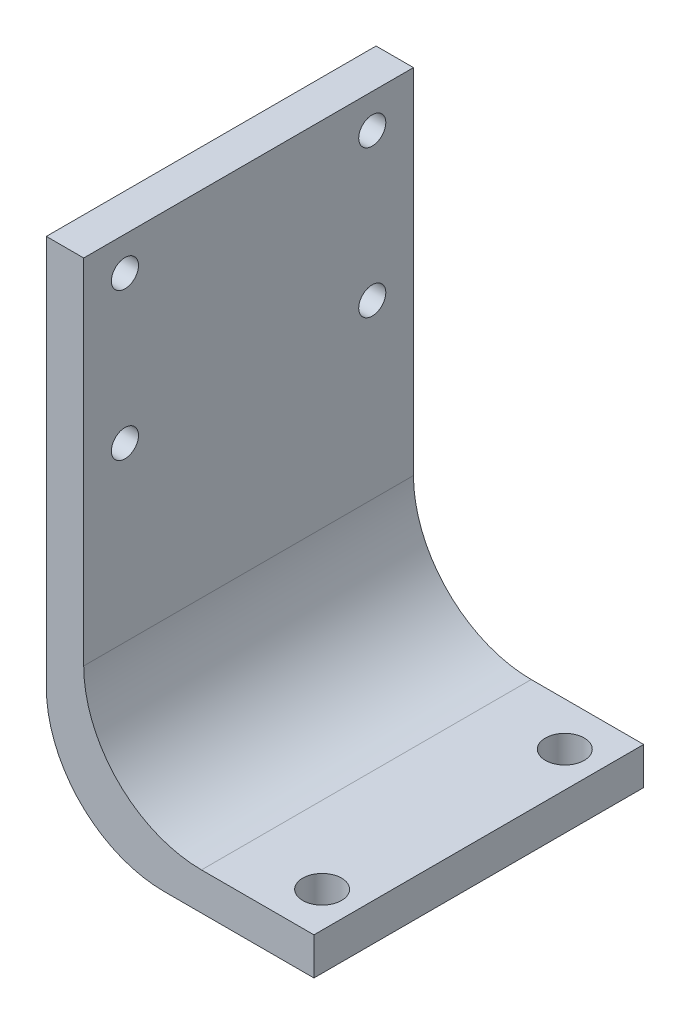
ISO-10303-21;
HEADER;
FILE_DESCRIPTION(('STEP AP214'),'2;1');
FILE_NAME('part.step','',(''),(''),'','','');
FILE_SCHEMA(('AUTOMOTIVE_DESIGN { 1 0 10303 214 1 1 1 1 }'));
ENDSEC;
DATA;
#1=APPLICATION_CONTEXT('core data for automotive mechanical design processes');
#2=APPLICATION_PROTOCOL_DEFINITION('international standard','automotive_design',2000,#1);
#3=PRODUCT_CONTEXT('',#1,'mechanical');
#4=PRODUCT('Part','Part','',(#3));
#5=PRODUCT_RELATED_PRODUCT_CATEGORY('part','',(#4));
#6=PRODUCT_DEFINITION_FORMATION('','',#4);
#7=PRODUCT_DEFINITION_CONTEXT('part definition',#1,'design');
#8=PRODUCT_DEFINITION('design','',#6,#7);
#9=PRODUCT_DEFINITION_SHAPE('','',#8);
#10=(LENGTH_UNIT() NAMED_UNIT(*) SI_UNIT(.MILLI.,.METRE.));
#11=(NAMED_UNIT(*) PLANE_ANGLE_UNIT() SI_UNIT($,.RADIAN.));
#12=(NAMED_UNIT(*) SI_UNIT($,.STERADIAN.) SOLID_ANGLE_UNIT());
#13=UNCERTAINTY_MEASURE_WITH_UNIT(LENGTH_MEASURE(1.E-05),#10,'distance_accuracy_value','');
#14=(GEOMETRIC_REPRESENTATION_CONTEXT(3) GLOBAL_UNCERTAINTY_ASSIGNED_CONTEXT((#13)) GLOBAL_UNIT_ASSIGNED_CONTEXT((#10,
#11,#12)) REPRESENTATION_CONTEXT('',''));
#15=CARTESIAN_POINT('',(0.,0.,0.));
#16=DIRECTION('',(0.,0.,1.));
#17=DIRECTION('',(1.,0.,0.));
#18=AXIS2_PLACEMENT_3D('',#15,#16,#17);
#19=CARTESIAN_POINT('',(0.,3.175,0.));
#20=DIRECTION('',(0.,1.,0.));
#21=DIRECTION('',(0.,0.,1.));
#22=AXIS2_PLACEMENT_3D('',#19,#20,#21);
#23=PLANE('',#22);
#24=DIRECTION('',(-1.,0.,0.));
#25=VECTOR('',#24,1.);
#26=CARTESIAN_POINT('',(-11.3613948858969,3.175,-14.));
#27=LINE('',#26,#25);
#28=CARTESIAN_POINT('',(11.3613948858969,3.175,-14.));
#29=VERTEX_POINT('',#28);
#30=CARTESIAN_POINT('',(1.8136051141031,3.175,-14.));
#31=VERTEX_POINT('',#30);
#32=EDGE_CURVE('E149',#29,#31,#27,.T.);
#33=ORIENTED_EDGE('',*,*,#32,.T.);
#34=DIRECTION('',(0.,0.,-1.));
#35=VECTOR('',#34,1.);
#36=CARTESIAN_POINT('',(1.8136051141031,3.175,0.));
#37=LINE('',#36,#35);
#38=CARTESIAN_POINT('',(1.8136051141031,3.175,14.));
#39=VERTEX_POINT('',#38);
#40=EDGE_CURVE('E175',#31,#39,#37,.F.);
#41=ORIENTED_EDGE('',*,*,#40,.T.);
#42=DIRECTION('',(1.,0.,0.));
#43=VECTOR('',#42,1.);
#44=CARTESIAN_POINT('',(-11.3613948858969,3.175,14.));
#45=LINE('',#44,#43);
#46=CARTESIAN_POINT('',(11.3613948858969,3.175,14.));
#47=VERTEX_POINT('',#46);
#48=EDGE_CURVE('E152',#39,#47,#45,.T.);
#49=ORIENTED_EDGE('',*,*,#48,.T.);
#50=DIRECTION('',(0.,0.,-1.));
#51=VECTOR('',#50,1.);
#52=CARTESIAN_POINT('',(11.3613948858969,3.175,-14.));
#53=LINE('',#52,#51);
#54=EDGE_CURVE('E146',#47,#29,#53,.T.);
#55=ORIENTED_EDGE('',*,*,#54,.T.);
#56=EDGE_LOOP('',(#33,#41,#49,#55));
#57=FACE_BOUND('',#56,.T.);
#58=CARTESIAN_POINT('',(8.3613948858969,3.175,-10.3032708200174));
#59=DIRECTION('',(0.,1.,0.));
#60=DIRECTION('',(0.,0.,1.));
#61=AXIS2_PLACEMENT_3D('',#58,#59,#60);
#62=CIRCLE('',#61,1.65);
#63=CARTESIAN_POINT('',(8.3613948858969,3.175,-8.65327082001741));
#64=VERTEX_POINT('',#63);
#65=EDGE_CURVE('E140',#64,#64,#62,.T.);
#66=ORIENTED_EDGE('',*,*,#65,.F.);
#67=EDGE_LOOP('',(#66));
#68=FACE_BOUND('',#67,.T.);
#69=CARTESIAN_POINT('',(8.3613948858969,3.175,10.3032708200174));
#70=DIRECTION('',(0.,1.,0.));
#71=DIRECTION('',(0.,0.,1.));
#72=AXIS2_PLACEMENT_3D('',#69,#70,#71);
#73=CIRCLE('',#72,1.65);
#74=CARTESIAN_POINT('',(8.3613948858969,3.175,11.9532708200174));
#75=VERTEX_POINT('',#74);
#76=EDGE_CURVE('E134',#75,#75,#73,.T.);
#77=ORIENTED_EDGE('',*,*,#76,.F.);
#78=EDGE_LOOP('',(#77));
#79=FACE_BOUND('',#78,.T.);
#80=ADVANCED_FACE('F32',(#57,#68,#79),#23,.T.);
#81=CARTESIAN_POINT('',(0.,0.,0.));
#82=DIRECTION('',(0.,1.,0.));
#83=DIRECTION('',(0.,0.,1.));
#84=AXIS2_PLACEMENT_3D('',#81,#82,#83);
#85=PLANE('',#84);
#86=DIRECTION('',(1.,0.,0.));
#87=VECTOR('',#86,1.);
#88=CARTESIAN_POINT('',(-11.3613948858969,0.,14.));
#89=LINE('',#88,#87);
#90=CARTESIAN_POINT('',(-1.3613948858969,0.,14.));
#91=VERTEX_POINT('',#90);
#92=CARTESIAN_POINT('',(11.3613948858969,0.,14.));
#93=VERTEX_POINT('',#92);
#94=EDGE_CURVE('E150',#91,#93,#89,.T.);
#95=ORIENTED_EDGE('',*,*,#94,.F.);
#96=DIRECTION('',(0.,0.,1.));
#97=VECTOR('',#96,1.);
#98=CARTESIAN_POINT('',(-1.3613948858969,0.,0.));
#99=LINE('',#98,#97);
#100=CARTESIAN_POINT('',(-1.3613948858969,0.,-14.));
#101=VERTEX_POINT('',#100);
#102=EDGE_CURVE('E169',#91,#101,#99,.F.);
#103=ORIENTED_EDGE('',*,*,#102,.T.);
#104=DIRECTION('',(-1.,0.,0.));
#105=VECTOR('',#104,1.);
#106=CARTESIAN_POINT('',(-11.3613948858969,0.,-14.));
#107=LINE('',#106,#105);
#108=CARTESIAN_POINT('',(11.3613948858969,0.,-14.));
#109=VERTEX_POINT('',#108);
#110=EDGE_CURVE('E156',#109,#101,#107,.T.);
#111=ORIENTED_EDGE('',*,*,#110,.F.);
#112=DIRECTION('',(0.,0.,-1.));
#113=VECTOR('',#112,1.);
#114=CARTESIAN_POINT('',(11.3613948858969,0.,-14.));
#115=LINE('',#114,#113);
#116=EDGE_CURVE('E143',#93,#109,#115,.T.);
#117=ORIENTED_EDGE('',*,*,#116,.F.);
#118=EDGE_LOOP('',(#95,#103,#111,#117));
#119=FACE_BOUND('',#118,.T.);
#120=CARTESIAN_POINT('',(8.3613948858969,0.,-10.3032708200174));
#121=DIRECTION('',(0.,1.,0.));
#122=DIRECTION('',(0.,0.,1.));
#123=AXIS2_PLACEMENT_3D('',#120,#121,#122);
#124=CIRCLE('',#123,1.65);
#125=CARTESIAN_POINT('',(8.3613948858969,0.,-8.65327082001741));
#126=VERTEX_POINT('',#125);
#127=EDGE_CURVE('E137',#126,#126,#124,.T.);
#128=ORIENTED_EDGE('',*,*,#127,.T.);
#129=EDGE_LOOP('',(#128));
#130=FACE_BOUND('',#129,.T.);
#131=CARTESIAN_POINT('',(8.3613948858969,0.,10.3032708200174));
#132=DIRECTION('',(0.,1.,0.));
#133=DIRECTION('',(0.,0.,1.));
#134=AXIS2_PLACEMENT_3D('',#131,#132,#133);
#135=CIRCLE('',#134,1.65);
#136=CARTESIAN_POINT('',(8.3613948858969,0.,11.9532708200174));
#137=VERTEX_POINT('',#136);
#138=EDGE_CURVE('E133',#137,#137,#135,.T.);
#139=ORIENTED_EDGE('',*,*,#138,.T.);
#140=EDGE_LOOP('',(#139));
#141=FACE_BOUND('',#140,.T.);
#142=ADVANCED_FACE('F193',(#119,#130,#141),#85,.F.);
#143=CARTESIAN_POINT('',(11.3613948858969,3.175,-14.));
#144=DIRECTION('',(-1.,0.,0.));
#145=DIRECTION('',(0.,0.,1.));
#146=AXIS2_PLACEMENT_3D('',#143,#144,#145);
#147=PLANE('',#146);
#148=ORIENTED_EDGE('',*,*,#116,.T.);
#149=DIRECTION('',(0.,-1.,0.));
#150=VECTOR('',#149,1.);
#151=CARTESIAN_POINT('',(11.3613948858969,3.175,-14.));
#152=LINE('',#151,#150);
#153=EDGE_CURVE('E163',#29,#109,#152,.T.);
#154=ORIENTED_EDGE('',*,*,#153,.F.);
#155=ORIENTED_EDGE('',*,*,#54,.F.);
#156=DIRECTION('',(0.,-1.,0.));
#157=VECTOR('',#156,1.);
#158=CARTESIAN_POINT('',(11.3613948858969,3.175,14.));
#159=LINE('',#158,#157);
#160=EDGE_CURVE('E106',#47,#93,#159,.T.);
#161=ORIENTED_EDGE('',*,*,#160,.T.);
#162=EDGE_LOOP('',(#148,#154,#155,#161));
#163=FACE_BOUND('',#162,.T.);
#164=ADVANCED_FACE('F197',(#163),#147,.F.);
#165=CARTESIAN_POINT('',(-11.3613948858969,3.175,-14.));
#166=DIRECTION('',(0.,0.,1.));
#167=DIRECTION('',(1.,0.,0.));
#168=AXIS2_PLACEMENT_3D('',#165,#166,#167);
#169=PLANE('',#168);
#170=ORIENTED_EDGE('',*,*,#110,.T.);
#171=CARTESIAN_POINT('',(-1.3613948858969,10.,-14.));
#172=DIRECTION('',(0.,0.,1.));
#173=DIRECTION('',(1.,0.,0.));
#174=AXIS2_PLACEMENT_3D('',#171,#172,#173);
#175=CIRCLE('',#174,10.);
#176=CARTESIAN_POINT('',(-11.3613948858969,10.,-14.));
#177=VERTEX_POINT('',#176);
#178=EDGE_CURVE('E171',#101,#177,#175,.F.);
#179=ORIENTED_EDGE('',*,*,#178,.T.);
#180=DIRECTION('',(0.,-1.,0.));
#181=VECTOR('',#180,1.);
#182=CARTESIAN_POINT('',(-11.3613948858969,3.175,-14.));
#183=LINE('',#182,#181);
#184=CARTESIAN_POINT('',(-11.3613948858969,43.175,-14.));
#185=VERTEX_POINT('',#184);
#186=EDGE_CURVE('E105',#185,#177,#183,.T.);
#187=ORIENTED_EDGE('',*,*,#186,.F.);
#188=DIRECTION('',(-1.,0.,0.));
#189=VECTOR('',#188,1.);
#190=CARTESIAN_POINT('',(-11.3613948858969,43.175,-14.));
#191=LINE('',#190,#189);
#192=CARTESIAN_POINT('',(-8.1863948858969,43.175,-14.));
#193=VERTEX_POINT('',#192);
#194=EDGE_CURVE('E120',#193,#185,#191,.T.);
#195=ORIENTED_EDGE('',*,*,#194,.F.);
#196=DIRECTION('',(0.,-1.,0.));
#197=VECTOR('',#196,1.);
#198=CARTESIAN_POINT('',(-8.1863948858969,43.175,-14.));
#199=LINE('',#198,#197);
#200=CARTESIAN_POINT('',(-8.1863948858969,13.175,-14.));
#201=VERTEX_POINT('',#200);
#202=EDGE_CURVE('E130',#193,#201,#199,.T.);
#203=ORIENTED_EDGE('',*,*,#202,.T.);
#204=CARTESIAN_POINT('',(1.8136051141031,13.175,-14.));
#205=DIRECTION('',(0.,0.,1.));
#206=DIRECTION('',(1.,0.,0.));
#207=AXIS2_PLACEMENT_3D('',#204,#205,#206);
#208=CIRCLE('',#207,10.);
#209=EDGE_CURVE('E40',#201,#31,#208,.T.);
#210=ORIENTED_EDGE('',*,*,#209,.T.);
#211=ORIENTED_EDGE('',*,*,#32,.F.);
#212=ORIENTED_EDGE('',*,*,#153,.T.);
#213=EDGE_LOOP('',(#170,#179,#187,#195,#203,#210,#211,#212));
#214=FACE_BOUND('',#213,.T.);
#215=ADVANCED_FACE('F185',(#214),#169,.F.);
#216=CARTESIAN_POINT('',(-11.3613948858969,3.175,-14.));
#217=DIRECTION('',(1.,0.,0.));
#218=DIRECTION('',(0.,0.,-1.));
#219=AXIS2_PLACEMENT_3D('',#216,#217,#218);
#220=PLANE('',#219);
#221=CARTESIAN_POINT('',(-11.3613948858969,27.8057543953395,10.5));
#222=DIRECTION('',(-1.,0.,0.));
#223=DIRECTION('',(0.,0.,1.));
#224=AXIS2_PLACEMENT_3D('',#221,#222,#223);
#225=CIRCLE('',#224,1.15);
#226=CARTESIAN_POINT('',(-11.3613948858969,27.8057543953395,11.65));
#227=VERTEX_POINT('',#226);
#228=EDGE_CURVE('E223',#227,#227,#225,.T.);
#229=ORIENTED_EDGE('',*,*,#228,.F.);
#230=EDGE_LOOP('',(#229));
#231=FACE_BOUND('',#230,.T.);
#232=CARTESIAN_POINT('',(-11.3613948858969,40.3057543953395,-10.5));
#233=DIRECTION('',(-1.,0.,0.));
#234=DIRECTION('',(0.,0.,1.));
#235=AXIS2_PLACEMENT_3D('',#232,#233,#234);
#236=CIRCLE('',#235,1.15);
#237=CARTESIAN_POINT('',(-11.3613948858969,40.3057543953395,-9.35));
#238=VERTEX_POINT('',#237);
#239=EDGE_CURVE('E227',#238,#238,#236,.T.);
#240=ORIENTED_EDGE('',*,*,#239,.F.);
#241=EDGE_LOOP('',(#240));
#242=FACE_BOUND('',#241,.T.);
#243=CARTESIAN_POINT('',(-11.3613948858969,27.8057543953395,-10.5));
#244=DIRECTION('',(-1.,0.,0.));
#245=DIRECTION('',(0.,0.,1.));
#246=AXIS2_PLACEMENT_3D('',#243,#244,#245);
#247=CIRCLE('',#246,1.15);
#248=CARTESIAN_POINT('',(-11.3613948858969,27.8057543953395,-9.35));
#249=VERTEX_POINT('',#248);
#250=EDGE_CURVE('E231',#249,#249,#247,.T.);
#251=ORIENTED_EDGE('',*,*,#250,.F.);
#252=EDGE_LOOP('',(#251));
#253=FACE_BOUND('',#252,.T.);
#254=CARTESIAN_POINT('',(-11.3613948858969,40.3057543953395,10.5));
#255=DIRECTION('',(-1.,0.,0.));
#256=DIRECTION('',(0.,0.,1.));
#257=AXIS2_PLACEMENT_3D('',#254,#255,#256);
#258=CIRCLE('',#257,1.15);
#259=CARTESIAN_POINT('',(-11.3613948858969,40.3057543953395,11.65));
#260=VERTEX_POINT('',#259);
#261=EDGE_CURVE('E124',#260,#260,#258,.T.);
#262=ORIENTED_EDGE('',*,*,#261,.F.);
#263=EDGE_LOOP('',(#262));
#264=FACE_BOUND('',#263,.T.);
#265=ORIENTED_EDGE('',*,*,#186,.T.);
#266=DIRECTION('',(0.,0.,1.));
#267=VECTOR('',#266,1.);
#268=CARTESIAN_POINT('',(-11.3613948858969,10.,-14.));
#269=LINE('',#268,#267);
#270=CARTESIAN_POINT('',(-11.3613948858969,10.,14.));
#271=VERTEX_POINT('',#270);
#272=EDGE_CURVE('E103',#177,#271,#269,.T.);
#273=ORIENTED_EDGE('',*,*,#272,.T.);
#274=DIRECTION('',(0.,-1.,0.));
#275=VECTOR('',#274,1.);
#276=CARTESIAN_POINT('',(-11.3613948858969,3.175,14.));
#277=LINE('',#276,#275);
#278=CARTESIAN_POINT('',(-11.3613948858969,43.175,14.));
#279=VERTEX_POINT('',#278);
#280=EDGE_CURVE('E96',#279,#271,#277,.T.);
#281=ORIENTED_EDGE('',*,*,#280,.F.);
#282=DIRECTION('',(0.,0.,1.));
#283=VECTOR('',#282,1.);
#284=CARTESIAN_POINT('',(-11.3613948858969,43.175,-14.));
#285=LINE('',#284,#283);
#286=EDGE_CURVE('E101',#185,#279,#285,.T.);
#287=ORIENTED_EDGE('',*,*,#286,.F.);
#288=EDGE_LOOP('',(#265,#273,#281,#287));
#289=FACE_BOUND('',#288,.T.);
#290=ADVANCED_FACE('F99',(#231,#242,#253,#264,#289),#220,.F.);
#291=CARTESIAN_POINT('',(-11.3613948858969,3.175,14.));
#292=DIRECTION('',(0.,0.,-1.));
#293=DIRECTION('',(-1.,0.,0.));
#294=AXIS2_PLACEMENT_3D('',#291,#292,#293);
#295=PLANE('',#294);
#296=ORIENTED_EDGE('',*,*,#280,.T.);
#297=CARTESIAN_POINT('',(-1.3613948858969,10.,14.));
#298=DIRECTION('',(0.,0.,-1.));
#299=DIRECTION('',(-1.,0.,0.));
#300=AXIS2_PLACEMENT_3D('',#297,#298,#299);
#301=CIRCLE('',#300,10.);
#302=EDGE_CURVE('E167',#271,#91,#301,.F.);
#303=ORIENTED_EDGE('',*,*,#302,.T.);
#304=ORIENTED_EDGE('',*,*,#94,.T.);
#305=ORIENTED_EDGE('',*,*,#160,.F.);
#306=ORIENTED_EDGE('',*,*,#48,.F.);
#307=CARTESIAN_POINT('',(1.8136051141031,13.175,14.));
#308=DIRECTION('',(0.,0.,-1.));
#309=DIRECTION('',(-1.,0.,0.));
#310=AXIS2_PLACEMENT_3D('',#307,#308,#309);
#311=CIRCLE('',#310,10.);
#312=CARTESIAN_POINT('',(-8.1863948858969,13.175,14.));
#313=VERTEX_POINT('',#312);
#314=EDGE_CURVE('E11',#39,#313,#311,.T.);
#315=ORIENTED_EDGE('',*,*,#314,.T.);
#316=DIRECTION('',(0.,-1.,0.));
#317=VECTOR('',#316,1.);
#318=CARTESIAN_POINT('',(-8.1863948858969,43.175,14.));
#319=LINE('',#318,#317);
#320=CARTESIAN_POINT('',(-8.1863948858969,43.175,14.));
#321=VERTEX_POINT('',#320);
#322=EDGE_CURVE('E112',#321,#313,#319,.T.);
#323=ORIENTED_EDGE('',*,*,#322,.F.);
#324=DIRECTION('',(1.,0.,0.));
#325=VECTOR('',#324,1.);
#326=CARTESIAN_POINT('',(-11.3613948858969,43.175,14.));
#327=LINE('',#326,#325);
#328=EDGE_CURVE('E109',#279,#321,#327,.T.);
#329=ORIENTED_EDGE('',*,*,#328,.F.);
#330=EDGE_LOOP('',(#296,#303,#304,#305,#306,#315,#323,#329));
#331=FACE_BOUND('',#330,.T.);
#332=ADVANCED_FACE('F110',(#331),#295,.F.);
#333=CARTESIAN_POINT('',(8.3613948858969,3.175,-10.3032708200174));
#334=DIRECTION('',(0.,-1.,0.));
#335=DIRECTION('',(0.,0.,-1.));
#336=AXIS2_PLACEMENT_3D('',#333,#334,#335);
#337=CYLINDRICAL_SURFACE('',#336,1.65);
#338=ORIENTED_EDGE('',*,*,#65,.T.);
#339=EDGE_LOOP('',(#338));
#340=FACE_BOUND('',#339,.T.);
#341=ORIENTED_EDGE('',*,*,#127,.F.);
#342=EDGE_LOOP('',(#341));
#343=FACE_BOUND('',#342,.T.);
#344=ADVANCED_FACE('F211',(#340,#343),#337,.F.);
#345=CARTESIAN_POINT('',(8.3613948858969,3.175,10.3032708200174));
#346=DIRECTION('',(0.,-1.,0.));
#347=DIRECTION('',(0.,0.,-1.));
#348=AXIS2_PLACEMENT_3D('',#345,#346,#347);
#349=CYLINDRICAL_SURFACE('',#348,1.65);
#350=ORIENTED_EDGE('',*,*,#76,.T.);
#351=EDGE_LOOP('',(#350));
#352=FACE_BOUND('',#351,.T.);
#353=ORIENTED_EDGE('',*,*,#138,.F.);
#354=EDGE_LOOP('',(#353));
#355=FACE_BOUND('',#354,.T.);
#356=ADVANCED_FACE('F270',(#352,#355),#349,.F.);
#357=CARTESIAN_POINT('',(-8.1863948858969,43.175,-14.));
#358=DIRECTION('',(-1.,0.,0.));
#359=DIRECTION('',(0.,0.,1.));
#360=AXIS2_PLACEMENT_3D('',#357,#358,#359);
#361=PLANE('',#360);
#362=CARTESIAN_POINT('',(-8.1863948858969,27.8057543953395,10.5));
#363=DIRECTION('',(-1.,0.,0.));
#364=DIRECTION('',(0.,0.,1.));
#365=AXIS2_PLACEMENT_3D('',#362,#363,#364);
#366=CIRCLE('',#365,1.15);
#367=CARTESIAN_POINT('',(-8.1863948858969,27.8057543953395,11.65));
#368=VERTEX_POINT('',#367);
#369=EDGE_CURVE('E235',#368,#368,#366,.F.);
#370=ORIENTED_EDGE('',*,*,#369,.F.);
#371=EDGE_LOOP('',(#370));
#372=FACE_BOUND('',#371,.T.);
#373=CARTESIAN_POINT('',(-8.1863948858969,40.3057543953395,-10.5));
#374=DIRECTION('',(-1.,0.,0.));
#375=DIRECTION('',(0.,0.,1.));
#376=AXIS2_PLACEMENT_3D('',#373,#374,#375);
#377=CIRCLE('',#376,1.15);
#378=CARTESIAN_POINT('',(-8.1863948858969,40.3057543953395,-9.35));
#379=VERTEX_POINT('',#378);
#380=EDGE_CURVE('E239',#379,#379,#377,.F.);
#381=ORIENTED_EDGE('',*,*,#380,.F.);
#382=EDGE_LOOP('',(#381));
#383=FACE_BOUND('',#382,.T.);
#384=CARTESIAN_POINT('',(-8.1863948858969,27.8057543953395,-10.5));
#385=DIRECTION('',(-1.,0.,0.));
#386=DIRECTION('',(0.,0.,1.));
#387=AXIS2_PLACEMENT_3D('',#384,#385,#386);
#388=CIRCLE('',#387,1.15);
#389=CARTESIAN_POINT('',(-8.1863948858969,27.8057543953395,-9.35));
#390=VERTEX_POINT('',#389);
#391=EDGE_CURVE('E242',#390,#390,#388,.F.);
#392=ORIENTED_EDGE('',*,*,#391,.F.);
#393=EDGE_LOOP('',(#392));
#394=FACE_BOUND('',#393,.T.);
#395=CARTESIAN_POINT('',(-8.1863948858969,40.3057543953395,10.5));
#396=DIRECTION('',(-1.,0.,0.));
#397=DIRECTION('',(0.,0.,1.));
#398=AXIS2_PLACEMENT_3D('',#395,#396,#397);
#399=CIRCLE('',#398,1.15);
#400=CARTESIAN_POINT('',(-8.1863948858969,40.3057543953395,11.65));
#401=VERTEX_POINT('',#400);
#402=EDGE_CURVE('E121',#401,#401,#399,.F.);
#403=ORIENTED_EDGE('',*,*,#402,.F.);
#404=EDGE_LOOP('',(#403));
#405=FACE_BOUND('',#404,.T.);
#406=ORIENTED_EDGE('',*,*,#322,.T.);
#407=DIRECTION('',(0.,0.,-1.));
#408=VECTOR('',#407,1.);
#409=CARTESIAN_POINT('',(-8.1863948858969,13.175,-14.));
#410=LINE('',#409,#408);
#411=EDGE_CURVE('E173',#313,#201,#410,.T.);
#412=ORIENTED_EDGE('',*,*,#411,.T.);
#413=ORIENTED_EDGE('',*,*,#202,.F.);
#414=DIRECTION('',(0.,0.,-1.));
#415=VECTOR('',#414,1.);
#416=CARTESIAN_POINT('',(-8.1863948858969,43.175,-14.));
#417=LINE('',#416,#415);
#418=EDGE_CURVE('E115',#321,#193,#417,.T.);
#419=ORIENTED_EDGE('',*,*,#418,.F.);
#420=EDGE_LOOP('',(#406,#412,#413,#419));
#421=FACE_BOUND('',#420,.T.);
#422=ADVANCED_FACE('F184',(#372,#383,#394,#405,#421),#361,.F.);
#423=CARTESIAN_POINT('',(0.,43.175,0.));
#424=DIRECTION('',(0.,1.,0.));
#425=DIRECTION('',(0.,0.,1.));
#426=AXIS2_PLACEMENT_3D('',#423,#424,#425);
#427=PLANE('',#426);
#428=ORIENTED_EDGE('',*,*,#286,.T.);
#429=ORIENTED_EDGE('',*,*,#328,.T.);
#430=ORIENTED_EDGE('',*,*,#418,.T.);
#431=ORIENTED_EDGE('',*,*,#194,.T.);
#432=EDGE_LOOP('',(#428,#429,#430,#431));
#433=FACE_BOUND('',#432,.T.);
#434=ADVANCED_FACE('F118',(#433),#427,.T.);
#435=CARTESIAN_POINT('',(-1.3613948858969,10.,-14.));
#436=DIRECTION('',(0.,0.,1.));
#437=DIRECTION('',(1.,0.,0.));
#438=AXIS2_PLACEMENT_3D('',#435,#436,#437);
#439=CYLINDRICAL_SURFACE('',#438,10.);
#440=ORIENTED_EDGE('',*,*,#178,.F.);
#441=ORIENTED_EDGE('',*,*,#102,.F.);
#442=ORIENTED_EDGE('',*,*,#302,.F.);
#443=ORIENTED_EDGE('',*,*,#272,.F.);
#444=EDGE_LOOP('',(#440,#441,#442,#443));
#445=FACE_BOUND('',#444,.T.);
#446=ADVANCED_FACE('F188',(#445),#439,.T.);
#447=CARTESIAN_POINT('',(1.8136051141031,13.175,-14.));
#448=DIRECTION('',(0.,0.,-1.));
#449=DIRECTION('',(-1.,0.,0.));
#450=AXIS2_PLACEMENT_3D('',#447,#448,#449);
#451=CYLINDRICAL_SURFACE('',#450,10.);
#452=ORIENTED_EDGE('',*,*,#314,.F.);
#453=ORIENTED_EDGE('',*,*,#40,.F.);
#454=ORIENTED_EDGE('',*,*,#209,.F.);
#455=ORIENTED_EDGE('',*,*,#411,.F.);
#456=EDGE_LOOP('',(#452,#453,#454,#455));
#457=FACE_BOUND('',#456,.T.);
#458=ADVANCED_FACE('F34',(#457),#451,.F.);
#459=CARTESIAN_POINT('',(-4.93370369243878,40.3057543953395,10.5));
#460=DIRECTION('',(-1.,0.,0.));
#461=DIRECTION('',(0.,0.,1.));
#462=AXIS2_PLACEMENT_3D('',#459,#460,#461);
#463=CYLINDRICAL_SURFACE('',#462,1.15);
#464=ORIENTED_EDGE('',*,*,#402,.T.);
#465=EDGE_LOOP('',(#464));
#466=FACE_BOUND('',#465,.T.);
#467=ORIENTED_EDGE('',*,*,#261,.T.);
#468=EDGE_LOOP('',(#467));
#469=FACE_BOUND('',#468,.T.);
#470=ADVANCED_FACE('F251',(#466,#469),#463,.F.);
#471=CARTESIAN_POINT('',(-4.93370369243878,27.8057543953395,-10.5));
#472=DIRECTION('',(-1.,0.,0.));
#473=DIRECTION('',(0.,0.,1.));
#474=AXIS2_PLACEMENT_3D('',#471,#472,#473);
#475=CYLINDRICAL_SURFACE('',#474,1.15);
#476=ORIENTED_EDGE('',*,*,#391,.T.);
#477=EDGE_LOOP('',(#476));
#478=FACE_BOUND('',#477,.T.);
#479=ORIENTED_EDGE('',*,*,#250,.T.);
#480=EDGE_LOOP('',(#479));
#481=FACE_BOUND('',#480,.T.);
#482=ADVANCED_FACE('F248',(#478,#481),#475,.F.);
#483=CARTESIAN_POINT('',(-4.93370369243878,40.3057543953395,-10.5));
#484=DIRECTION('',(-1.,0.,0.));
#485=DIRECTION('',(0.,0.,1.));
#486=AXIS2_PLACEMENT_3D('',#483,#484,#485);
#487=CYLINDRICAL_SURFACE('',#486,1.15);
#488=ORIENTED_EDGE('',*,*,#380,.T.);
#489=EDGE_LOOP('',(#488));
#490=FACE_BOUND('',#489,.T.);
#491=ORIENTED_EDGE('',*,*,#239,.T.);
#492=EDGE_LOOP('',(#491));
#493=FACE_BOUND('',#492,.T.);
#494=ADVANCED_FACE('F250',(#490,#493),#487,.F.);
#495=CARTESIAN_POINT('',(-4.93370369243878,27.8057543953395,10.5));
#496=DIRECTION('',(-1.,0.,0.));
#497=DIRECTION('',(0.,0.,1.));
#498=AXIS2_PLACEMENT_3D('',#495,#496,#497);
#499=CYLINDRICAL_SURFACE('',#498,1.15);
#500=ORIENTED_EDGE('',*,*,#369,.T.);
#501=EDGE_LOOP('',(#500));
#502=FACE_BOUND('',#501,.T.);
#503=ORIENTED_EDGE('',*,*,#228,.T.);
#504=EDGE_LOOP('',(#503));
#505=FACE_BOUND('',#504,.T.);
#506=ADVANCED_FACE('F258',(#502,#505),#499,.F.);
#507=CLOSED_SHELL('',(#80,#142,#164,#215,#290,#332,#344,#356,#422,#434,#446,#458,#470,#482,#494,#506));
#508=MANIFOLD_SOLID_BREP('B2',#507);
#509=ADVANCED_BREP_SHAPE_REPRESENTATION('',(#18,#508),#14);
#510=SHAPE_DEFINITION_REPRESENTATION(#9,#509);
ENDSEC;
END-ISO-10303-21;
